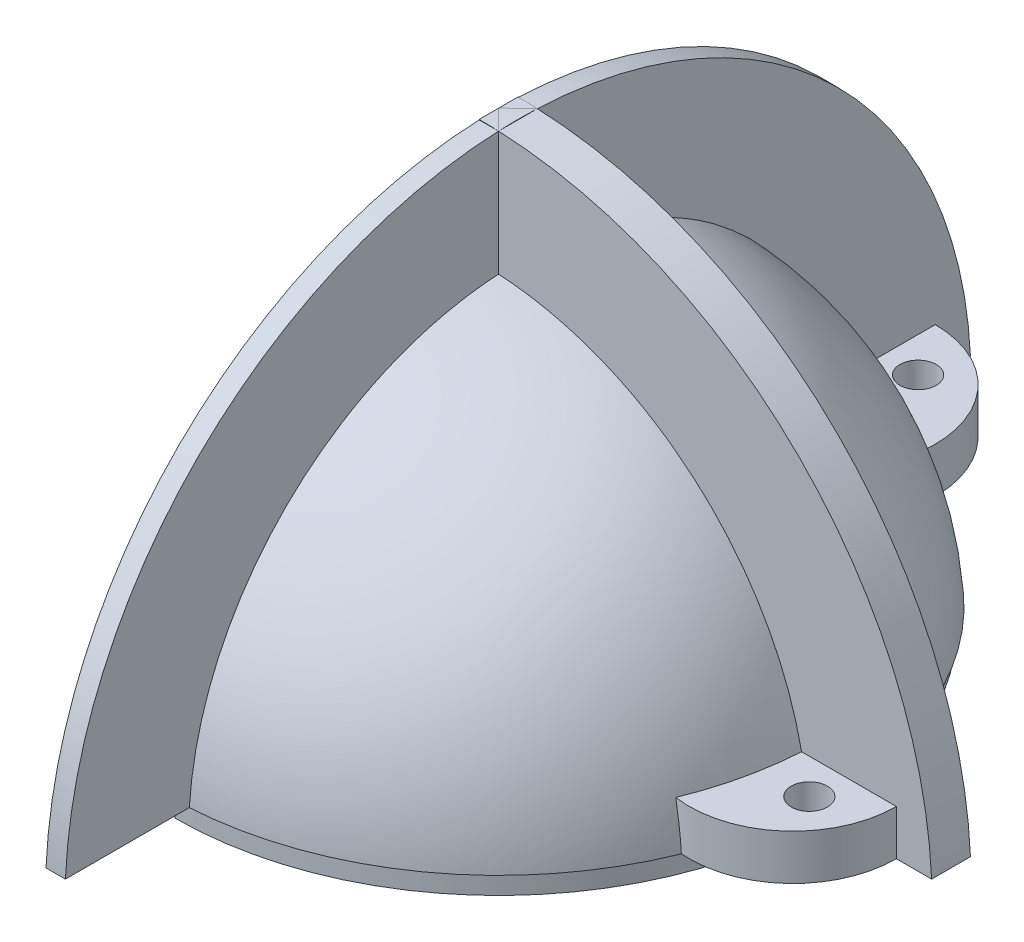
ISO-10303-21;
HEADER;
FILE_DESCRIPTION(('STEP AP214'),'2;1');
FILE_NAME('part.step','',(''),(''),'','','');
FILE_SCHEMA(('AUTOMOTIVE_DESIGN { 1 0 10303 214 1 1 1 1 }'));
ENDSEC;
DATA;
#1=APPLICATION_CONTEXT('core data for automotive mechanical design processes');
#2=APPLICATION_PROTOCOL_DEFINITION('international standard','automotive_design',2000,#1);
#3=PRODUCT_CONTEXT('',#1,'mechanical');
#4=PRODUCT('Part','Part','',(#3));
#5=PRODUCT_RELATED_PRODUCT_CATEGORY('part','',(#4));
#6=PRODUCT_DEFINITION_FORMATION('','',#4);
#7=PRODUCT_DEFINITION_CONTEXT('part definition',#1,'design');
#8=PRODUCT_DEFINITION('design','',#6,#7);
#9=PRODUCT_DEFINITION_SHAPE('','',#8);
#10=(LENGTH_UNIT() NAMED_UNIT(*) SI_UNIT(.MILLI.,.METRE.));
#11=(NAMED_UNIT(*) PLANE_ANGLE_UNIT() SI_UNIT($,.RADIAN.));
#12=(NAMED_UNIT(*) SI_UNIT($,.STERADIAN.) SOLID_ANGLE_UNIT());
#13=UNCERTAINTY_MEASURE_WITH_UNIT(LENGTH_MEASURE(1.E-05),#10,'distance_accuracy_value','');
#14=(GEOMETRIC_REPRESENTATION_CONTEXT(3) GLOBAL_UNCERTAINTY_ASSIGNED_CONTEXT((#13)) GLOBAL_UNIT_ASSIGNED_CONTEXT((#10,
#11,#12)) REPRESENTATION_CONTEXT('',''));
#15=CARTESIAN_POINT('',(0.,0.,0.));
#16=DIRECTION('',(0.,0.,1.));
#17=DIRECTION('',(1.,0.,0.));
#18=AXIS2_PLACEMENT_3D('',#15,#16,#17);
#19=CARTESIAN_POINT('',(0.,0.,0.));
#20=DIRECTION('',(0.,1.,0.));
#21=DIRECTION('',(0.,0.,1.));
#22=AXIS2_PLACEMENT_3D('',#19,#20,#21);
#23=PLANE('',#22);
#24=CARTESIAN_POINT('',(0.,0.,0.));
#25=DIRECTION('',(0.,-1.,0.));
#26=DIRECTION('',(0.,0.,-1.));
#27=AXIS2_PLACEMENT_3D('',#24,#25,#26);
#28=CIRCLE('',#27,25.);
#29=CARTESIAN_POINT('',(0.,0.,-25.));
#30=VERTEX_POINT('',#29);
#31=CARTESIAN_POINT('',(0.,0.,25.));
#32=VERTEX_POINT('',#31);
#33=EDGE_CURVE('E366',#30,#32,#28,.T.);
#34=ORIENTED_EDGE('',*,*,#33,.T.);
#35=DIRECTION('',(0.,0.,-1.));
#36=VECTOR('',#35,1.);
#37=CARTESIAN_POINT('',(0.,0.,0.));
#38=LINE('',#37,#36);
#39=CARTESIAN_POINT('',(0.,0.,24.285));
#40=VERTEX_POINT('',#39);
#41=EDGE_CURVE('E368',#32,#40,#38,.T.);
#42=ORIENTED_EDGE('',*,*,#41,.T.);
#43=CARTESIAN_POINT('',(0.,0.,0.));
#44=DIRECTION('',(0.,-1.,0.));
#45=DIRECTION('',(0.,0.,-1.));
#46=AXIS2_PLACEMENT_3D('',#43,#44,#45);
#47=CIRCLE('',#46,24.285);
#48=CARTESIAN_POINT('',(0.,0.,-24.285));
#49=VERTEX_POINT('',#48);
#50=EDGE_CURVE('E229',#49,#40,#47,.T.);
#51=ORIENTED_EDGE('',*,*,#50,.F.);
#52=EDGE_CURVE('E370',#49,#30,#38,.T.);
#53=ORIENTED_EDGE('',*,*,#52,.T.);
#54=EDGE_LOOP('',(#34,#42,#51,#53));
#55=FACE_BOUND('',#54,.T.);
#56=ADVANCED_FACE('F39',(#55),#23,.F.);
#57=CARTESIAN_POINT('',(0.,0.,0.));
#58=DIRECTION('',(0.,-1.,0.));
#59=DIRECTION('',(0.,0.,-1.));
#60=AXIS2_PLACEMENT_3D('',#57,#58,#59);
#61=CYLINDRICAL_SURFACE('',#60,20.885);
#62=CARTESIAN_POINT('',(0.,0.,0.));
#63=DIRECTION('',(0.,-1.,0.));
#64=DIRECTION('',(0.,0.,-1.));
#65=AXIS2_PLACEMENT_3D('',#62,#63,#64);
#66=CIRCLE('',#65,20.885);
#67=CARTESIAN_POINT('',(0.,0.,-20.885));
#68=VERTEX_POINT('',#67);
#69=CARTESIAN_POINT('',(0.,0.,20.885));
#70=VERTEX_POINT('',#69);
#71=EDGE_CURVE('E241',#68,#70,#66,.T.);
#72=ORIENTED_EDGE('',*,*,#71,.T.);
#73=DIRECTION('',(0.,-1.,0.));
#74=VECTOR('',#73,1.);
#75=CARTESIAN_POINT('',(0.,0.,20.885));
#76=LINE('',#75,#74);
#77=CARTESIAN_POINT('',(0.,11.7939391214301,20.885));
#78=VERTEX_POINT('',#77);
#79=EDGE_CURVE('E54',#70,#78,#76,.F.);
#80=ORIENTED_EDGE('',*,*,#79,.T.);
#81=CARTESIAN_POINT('',(0.,11.7939391214301,0.));
#82=DIRECTION('',(0.,-1.,0.));
#83=DIRECTION('',(0.,0.,-1.));
#84=AXIS2_PLACEMENT_3D('',#81,#82,#83);
#85=CIRCLE('',#84,20.885);
#86=CARTESIAN_POINT('',(0.,11.7939391214301,-20.885));
#87=VERTEX_POINT('',#86);
#88=EDGE_CURVE('E227',#87,#78,#85,.T.);
#89=ORIENTED_EDGE('',*,*,#88,.F.);
#90=DIRECTION('',(0.,-1.,0.));
#91=VECTOR('',#90,1.);
#92=CARTESIAN_POINT('',(0.,0.,-20.885));
#93=LINE('',#92,#91);
#94=EDGE_CURVE('E395',#87,#68,#93,.T.);
#95=ORIENTED_EDGE('',*,*,#94,.T.);
#96=EDGE_LOOP('',(#72,#80,#89,#95));
#97=FACE_BOUND('',#96,.T.);
#98=ADVANCED_FACE('F41',(#97),#61,.F.);
#99=CARTESIAN_POINT('',(0.,0.,0.));
#100=DIRECTION('',(0.,-1.,0.));
#101=DIRECTION('',(-1.,0.,0.));
#102=AXIS2_PLACEMENT_3D('',#99,#100,#101);
#103=SPHERICAL_SURFACE('',#102,23.985);
#104=ORIENTED_EDGE('',*,*,#88,.T.);
#105=CARTESIAN_POINT('',(0.,0.,0.));
#106=DIRECTION('',(1.,0.,0.));
#107=DIRECTION('',(0.,0.,-1.));
#108=AXIS2_PLACEMENT_3D('',#105,#106,#107);
#109=CIRCLE('',#108,23.985);
#110=EDGE_CURVE('E60',#78,#87,#109,.F.);
#111=ORIENTED_EDGE('',*,*,#110,.T.);
#112=EDGE_LOOP('',(#104,#111));
#113=FACE_BOUND('',#112,.T.);
#114=ADVANCED_FACE('F357',(#113),#103,.F.);
#115=CARTESIAN_POINT('',(0.,0.,0.));
#116=DIRECTION('',(0.,-1.,0.));
#117=DIRECTION('',(0.,0.,-1.));
#118=AXIS2_PLACEMENT_3D('',#115,#116,#117);
#119=CYLINDRICAL_SURFACE('',#118,24.285);
#120=ORIENTED_EDGE('',*,*,#50,.T.);
#121=DIRECTION('',(0.,-1.,0.));
#122=VECTOR('',#121,1.);
#123=CARTESIAN_POINT('',(0.,0.,24.285));
#124=LINE('',#123,#122);
#125=CARTESIAN_POINT('',(0.,0.5,24.285));
#126=VERTEX_POINT('',#125);
#127=EDGE_CURVE('E378',#40,#126,#124,.F.);
#128=ORIENTED_EDGE('',*,*,#127,.T.);
#129=CARTESIAN_POINT('',(0.,0.5,0.));
#130=DIRECTION('',(0.,-1.,0.));
#131=DIRECTION('',(0.,0.,-1.));
#132=AXIS2_PLACEMENT_3D('',#129,#130,#131);
#133=CIRCLE('',#132,24.285);
#134=CARTESIAN_POINT('',(0.,0.5,-24.285));
#135=VERTEX_POINT('',#134);
#136=EDGE_CURVE('E232',#135,#126,#133,.T.);
#137=ORIENTED_EDGE('',*,*,#136,.F.);
#138=DIRECTION('',(0.,-1.,0.));
#139=VECTOR('',#138,1.);
#140=CARTESIAN_POINT('',(0.,0.,-24.285));
#141=LINE('',#140,#139);
#142=EDGE_CURVE('E385',#135,#49,#141,.T.);
#143=ORIENTED_EDGE('',*,*,#142,.T.);
#144=EDGE_LOOP('',(#120,#128,#137,#143));
#145=FACE_BOUND('',#144,.T.);
#146=ADVANCED_FACE('F354',(#145),#119,.F.);
#147=CARTESIAN_POINT('',(0.,0.5,0.));
#148=DIRECTION('',(0.,1.,0.));
#149=DIRECTION('',(0.,0.,1.));
#150=AXIS2_PLACEMENT_3D('',#147,#148,#149);
#151=PLANE('',#150);
#152=ORIENTED_EDGE('',*,*,#136,.T.);
#153=DIRECTION('',(0.,0.,-1.));
#154=VECTOR('',#153,1.);
#155=CARTESIAN_POINT('',(0.,0.5,0.));
#156=LINE('',#155,#154);
#157=CARTESIAN_POINT('',(0.,0.5,22.085));
#158=VERTEX_POINT('',#157);
#159=EDGE_CURVE('E497',#126,#158,#156,.T.);
#160=ORIENTED_EDGE('',*,*,#159,.T.);
#161=CARTESIAN_POINT('',(0.,0.5,0.));
#162=DIRECTION('',(0.,-1.,0.));
#163=DIRECTION('',(0.,0.,-1.));
#164=AXIS2_PLACEMENT_3D('',#161,#162,#163);
#165=CIRCLE('',#164,22.085);
#166=CARTESIAN_POINT('',(0.,0.5,-22.085));
#167=VERTEX_POINT('',#166);
#168=EDGE_CURVE('E235',#167,#158,#165,.T.);
#169=ORIENTED_EDGE('',*,*,#168,.F.);
#170=EDGE_CURVE('E374',#167,#135,#156,.T.);
#171=ORIENTED_EDGE('',*,*,#170,.T.);
#172=EDGE_LOOP('',(#152,#160,#169,#171));
#173=FACE_BOUND('',#172,.T.);
#174=ADVANCED_FACE('F350',(#173),#151,.F.);
#175=CARTESIAN_POINT('',(0.,0.,0.));
#176=DIRECTION('',(0.,-1.,0.));
#177=DIRECTION('',(0.,0.,-1.));
#178=AXIS2_PLACEMENT_3D('',#175,#176,#177);
#179=CYLINDRICAL_SURFACE('',#178,22.085);
#180=DIRECTION('',(0.,-1.,0.));
#181=VECTOR('',#180,1.);
#182=CARTESIAN_POINT('',(0.,0.,22.085));
#183=LINE('',#182,#181);
#184=CARTESIAN_POINT('',(0.,0.,22.085));
#185=VERTEX_POINT('',#184);
#186=EDGE_CURVE('E496',#185,#158,#183,.F.);
#187=ORIENTED_EDGE('',*,*,#186,.F.);
#188=CARTESIAN_POINT('',(0.,0.,0.));
#189=DIRECTION('',(0.,-1.,0.));
#190=DIRECTION('',(0.,0.,-1.));
#191=AXIS2_PLACEMENT_3D('',#188,#189,#190);
#192=CIRCLE('',#191,22.085);
#193=CARTESIAN_POINT('',(0.,0.,-22.085));
#194=VERTEX_POINT('',#193);
#195=EDGE_CURVE('E238',#194,#185,#192,.T.);
#196=ORIENTED_EDGE('',*,*,#195,.F.);
#197=DIRECTION('',(0.,-1.,0.));
#198=VECTOR('',#197,1.);
#199=CARTESIAN_POINT('',(0.,0.,-22.085));
#200=LINE('',#199,#198);
#201=EDGE_CURVE('E397',#167,#194,#200,.T.);
#202=ORIENTED_EDGE('',*,*,#201,.F.);
#203=ORIENTED_EDGE('',*,*,#168,.T.);
#204=EDGE_LOOP('',(#187,#196,#202,#203));
#205=FACE_BOUND('',#204,.T.);
#206=ADVANCED_FACE('F346',(#205),#179,.T.);
#207=CARTESIAN_POINT('',(0.,0.,0.));
#208=DIRECTION('',(0.,1.,0.));
#209=DIRECTION('',(0.,0.,1.));
#210=AXIS2_PLACEMENT_3D('',#207,#208,#209);
#211=PLANE('',#210);
#212=ORIENTED_EDGE('',*,*,#195,.T.);
#213=DIRECTION('',(0.,0.,-1.));
#214=VECTOR('',#213,1.);
#215=CARTESIAN_POINT('',(0.,0.,0.));
#216=LINE('',#215,#214);
#217=EDGE_CURVE('E387',#185,#70,#216,.T.);
#218=ORIENTED_EDGE('',*,*,#217,.T.);
#219=ORIENTED_EDGE('',*,*,#71,.F.);
#220=EDGE_CURVE('E391',#68,#194,#216,.T.);
#221=ORIENTED_EDGE('',*,*,#220,.T.);
#222=EDGE_LOOP('',(#212,#218,#219,#221));
#223=FACE_BOUND('',#222,.T.);
#224=ADVANCED_FACE('F342',(#223),#211,.F.);
#225=CARTESIAN_POINT('',(0.,75.1891052434009,0.));
#226=DIRECTION('',(0.,-1.,0.));
#227=DIRECTION('',(0.,0.,-1.));
#228=AXIS2_PLACEMENT_3D('',#225,#226,#227);
#229=CYLINDRICAL_SURFACE('',#228,25.);
#230=DIRECTION('',(0.,-1.,0.));
#231=VECTOR('',#230,1.);
#232=CARTESIAN_POINT('',(0.,75.1891052434009,25.));
#233=LINE('',#232,#231);
#234=CARTESIAN_POINT('',(0.,1.65,25.));
#235=VERTEX_POINT('',#234);
#236=EDGE_CURVE('E212',#32,#235,#233,.F.);
#237=ORIENTED_EDGE('',*,*,#236,.F.);
#238=ORIENTED_EDGE('',*,*,#33,.F.);
#239=DIRECTION('',(0.,-1.,0.));
#240=VECTOR('',#239,1.);
#241=CARTESIAN_POINT('',(0.,75.1891052434009,-25.));
#242=LINE('',#241,#240);
#243=CARTESIAN_POINT('',(0.,1.65,-25.));
#244=VERTEX_POINT('',#243);
#245=EDGE_CURVE('E389',#244,#30,#242,.T.);
#246=ORIENTED_EDGE('',*,*,#245,.F.);
#247=CARTESIAN_POINT('',(0.,1.65,0.));
#248=DIRECTION('',(0.,-1.,0.));
#249=DIRECTION('',(0.,0.,-1.));
#250=AXIS2_PLACEMENT_3D('',#247,#248,#249);
#251=CIRCLE('',#250,25.);
#252=EDGE_CURVE('E373',#235,#244,#251,.F.);
#253=ORIENTED_EDGE('',*,*,#252,.F.);
#254=EDGE_LOOP('',(#237,#238,#246,#253));
#255=FACE_BOUND('',#254,.T.);
#256=ADVANCED_FACE('F345',(#255),#229,.T.);
#257=CARTESIAN_POINT('',(0.,0.,-1.5));
#258=DIRECTION('',(0.,0.,1.));
#259=DIRECTION('',(1.,0.,0.));
#260=AXIS2_PLACEMENT_3D('',#257,#258,#259);
#261=CYLINDRICAL_SURFACE('',#260,35.);
#262=DIRECTION('',(0.,0.,1.));
#263=VECTOR('',#262,1.);
#264=CARTESIAN_POINT('',(0.,35.,-1.5));
#265=LINE('',#264,#263);
#266=CARTESIAN_POINT('',(0.,35.,1.5));
#267=VERTEX_POINT('',#266);
#268=CARTESIAN_POINT('',(0.,35.,0.));
#269=VERTEX_POINT('',#268);
#270=EDGE_CURVE('E383',#267,#269,#265,.F.);
#271=ORIENTED_EDGE('',*,*,#270,.F.);
#272=CARTESIAN_POINT('',(0.,0.,1.5));
#273=DIRECTION('',(0.,0.,1.));
#274=DIRECTION('',(-1.,0.,0.));
#275=AXIS2_PLACEMENT_3D('',#272,#273,#274);
#276=CIRCLE('',#275,35.);
#277=CARTESIAN_POINT('',(1.5,34.9678423698117,1.5));
#278=VERTEX_POINT('',#277);
#279=EDGE_CURVE('E257',#278,#267,#276,.T.);
#280=ORIENTED_EDGE('',*,*,#279,.F.);
#281=CARTESIAN_POINT('',(0.,0.,0.));
#282=DIRECTION('',(-0.707106781186547,0.,0.707106781186547));
#283=DIRECTION('',(0.707106781186547,0.,0.707106781186547));
#284=AXIS2_PLACEMENT_3D('',#281,#282,#283);
#285=ELLIPSE('',#284,49.4974746830583,35.);
#286=EDGE_CURVE('E263',#269,#278,#285,.F.);
#287=ORIENTED_EDGE('',*,*,#286,.F.);
#288=EDGE_LOOP('',(#271,#280,#287));
#289=FACE_BOUND('',#288,.T.);
#290=ADVANCED_FACE('F321',(#289),#261,.T.);
#291=CARTESIAN_POINT('',(-1.5,0.,0.));
#292=DIRECTION('',(1.,0.,0.));
#293=DIRECTION('',(0.,0.,-1.));
#294=AXIS2_PLACEMENT_3D('',#291,#292,#293);
#295=CYLINDRICAL_SURFACE('',#294,35.);
#296=CARTESIAN_POINT('',(1.5,0.,0.));
#297=DIRECTION('',(1.,0.,0.));
#298=DIRECTION('',(0.,0.,-1.));
#299=AXIS2_PLACEMENT_3D('',#296,#297,#298);
#300=CIRCLE('',#299,35.);
#301=CARTESIAN_POINT('',(1.5,34.9678423698117,-1.5));
#302=VERTEX_POINT('',#301);
#303=EDGE_CURVE('E273',#302,#278,#300,.T.);
#304=ORIENTED_EDGE('',*,*,#303,.F.);
#305=CARTESIAN_POINT('',(0.,0.,0.));
#306=DIRECTION('',(0.707106781186547,0.,0.707106781186547));
#307=DIRECTION('',(-0.707106781186547,0.,0.707106781186547));
#308=AXIS2_PLACEMENT_3D('',#305,#306,#307);
#309=ELLIPSE('',#308,49.4974746830583,35.);
#310=EDGE_CURVE('E258',#302,#269,#309,.T.);
#311=ORIENTED_EDGE('',*,*,#310,.T.);
#312=ORIENTED_EDGE('',*,*,#286,.T.);
#313=EDGE_LOOP('',(#304,#311,#312));
#314=FACE_BOUND('',#313,.T.);
#315=ADVANCED_FACE('F317',(#314),#295,.T.);
#316=DIRECTION('',(0.,0.,1.));
#317=VECTOR('',#316,1.);
#318=CARTESIAN_POINT('',(0.,35.,-1.5));
#319=LINE('',#318,#317);
#320=CARTESIAN_POINT('',(0.,35.,-1.5));
#321=VERTEX_POINT('',#320);
#322=EDGE_CURVE('E379',#269,#321,#319,.F.);
#323=ORIENTED_EDGE('',*,*,#322,.F.);
#324=ORIENTED_EDGE('',*,*,#310,.F.);
#325=CARTESIAN_POINT('',(0.,0.,-1.5));
#326=DIRECTION('',(0.,0.,1.));
#327=DIRECTION('',(-1.,0.,0.));
#328=AXIS2_PLACEMENT_3D('',#325,#326,#327);
#329=CIRCLE('',#328,35.);
#330=EDGE_CURVE('E253',#302,#321,#329,.T.);
#331=ORIENTED_EDGE('',*,*,#330,.T.);
#332=EDGE_LOOP('',(#323,#324,#331));
#333=FACE_BOUND('',#332,.T.);
#334=ADVANCED_FACE('F320',(#333),#261,.T.);
#335=CARTESIAN_POINT('',(0.,0.,1.5));
#336=DIRECTION('',(0.,0.,-1.));
#337=DIRECTION('',(-1.,0.,0.));
#338=AXIS2_PLACEMENT_3D('',#335,#336,#337);
#339=PLANE('',#338);
#340=ORIENTED_EDGE('',*,*,#279,.T.);
#341=DIRECTION('',(0.,-1.,0.));
#342=VECTOR('',#341,1.);
#343=CARTESIAN_POINT('',(0.,0.,1.5));
#344=LINE('',#343,#342);
#345=CARTESIAN_POINT('',(0.,34.9678423698117,1.5));
#346=VERTEX_POINT('',#345);
#347=EDGE_CURVE('E206',#267,#346,#344,.T.);
#348=ORIENTED_EDGE('',*,*,#347,.T.);
#349=DIRECTION('',(1.,0.,0.));
#350=VECTOR('',#349,1.);
#351=CARTESIAN_POINT('',(-1.5,34.9678423698117,1.5));
#352=LINE('',#351,#350);
#353=EDGE_CURVE('E203',#346,#278,#352,.T.);
#354=ORIENTED_EDGE('',*,*,#353,.T.);
#355=EDGE_LOOP('',(#340,#348,#354));
#356=FACE_BOUND('',#355,.T.);
#357=ADVANCED_FACE('F314',(#356),#339,.F.);
#358=CARTESIAN_POINT('',(1.5,0.,0.));
#359=DIRECTION('',(1.,0.,0.));
#360=DIRECTION('',(0.,0.,-1.));
#361=AXIS2_PLACEMENT_3D('',#358,#359,#360);
#362=PLANE('',#361);
#363=ORIENTED_EDGE('',*,*,#303,.T.);
#364=DIRECTION('',(0.,0.,1.));
#365=VECTOR('',#364,1.);
#366=CARTESIAN_POINT('',(1.5,34.9678423698117,-1.5));
#367=LINE('',#366,#365);
#368=EDGE_CURVE('E268',#278,#302,#367,.F.);
#369=ORIENTED_EDGE('',*,*,#368,.T.);
#370=EDGE_LOOP('',(#363,#369));
#371=FACE_BOUND('',#370,.T.);
#372=ADVANCED_FACE('F310',(#371),#362,.T.);
#373=CARTESIAN_POINT('',(0.,0.,-1.5));
#374=DIRECTION('',(0.,0.,-1.));
#375=DIRECTION('',(-1.,0.,0.));
#376=AXIS2_PLACEMENT_3D('',#373,#374,#375);
#377=PLANE('',#376);
#378=DIRECTION('',(0.,-1.,0.));
#379=VECTOR('',#378,1.);
#380=CARTESIAN_POINT('',(0.,0.,-1.5));
#381=LINE('',#380,#379);
#382=CARTESIAN_POINT('',(0.,34.9678423698117,-1.5));
#383=VERTEX_POINT('',#382);
#384=EDGE_CURVE('E495',#321,#383,#381,.T.);
#385=ORIENTED_EDGE('',*,*,#384,.F.);
#386=ORIENTED_EDGE('',*,*,#330,.F.);
#387=DIRECTION('',(1.,0.,0.));
#388=VECTOR('',#387,1.);
#389=CARTESIAN_POINT('',(-1.5,34.9678423698117,-1.5));
#390=LINE('',#389,#388);
#391=EDGE_CURVE('E261',#383,#302,#390,.T.);
#392=ORIENTED_EDGE('',*,*,#391,.F.);
#393=EDGE_LOOP('',(#385,#386,#392));
#394=FACE_BOUND('',#393,.T.);
#395=ADVANCED_FACE('F313',(#394),#377,.T.);
#396=CARTESIAN_POINT('',(0.,0.,0.));
#397=DIRECTION('',(1.,0.,0.));
#398=DIRECTION('',(0.,0.,-1.));
#399=AXIS2_PLACEMENT_3D('',#396,#397,#398);
#400=CIRCLE('',#399,35.);
#401=CARTESIAN_POINT('',(0.,1.65,34.9610855094632));
#402=VERTEX_POINT('',#401);
#403=EDGE_CURVE('E201',#402,#346,#400,.F.);
#404=ORIENTED_EDGE('',*,*,#403,.F.);
#405=DIRECTION('',(1.,0.,0.));
#406=VECTOR('',#405,1.);
#407=CARTESIAN_POINT('',(-1.5,1.65,34.9610855094632));
#408=LINE('',#407,#406);
#409=CARTESIAN_POINT('',(1.5,1.65,34.9610855094632));
#410=VERTEX_POINT('',#409);
#411=EDGE_CURVE('E185',#410,#402,#408,.F.);
#412=ORIENTED_EDGE('',*,*,#411,.F.);
#413=EDGE_CURVE('E197',#278,#410,#300,.T.);
#414=ORIENTED_EDGE('',*,*,#413,.F.);
#415=ORIENTED_EDGE('',*,*,#353,.F.);
#416=EDGE_LOOP('',(#404,#412,#414,#415));
#417=FACE_BOUND('',#416,.T.);
#418=ADVANCED_FACE('F202',(#417),#295,.T.);
#419=CARTESIAN_POINT('',(28.212839524984,5.15,4.2));
#420=DIRECTION('',(0.,-1.,0.));
#421=DIRECTION('',(0.,0.,-1.));
#422=AXIS2_PLACEMENT_3D('',#419,#420,#421);
#423=CYLINDRICAL_SURFACE('',#422,1.4);
#424=CARTESIAN_POINT('',(28.212839524984,5.15,4.2));
#425=DIRECTION('',(0.,-1.,0.));
#426=DIRECTION('',(0.,0.,-1.));
#427=AXIS2_PLACEMENT_3D('',#424,#425,#426);
#428=CIRCLE('',#427,1.4);
#429=CARTESIAN_POINT('',(28.212839524984,5.15,2.8));
#430=VERTEX_POINT('',#429);
#431=EDGE_CURVE('E445',#430,#430,#428,.T.);
#432=CARTESIAN_POINT('',(28.212839524984,1.65,4.2));
#433=DIRECTION('',(0.,-1.,0.));
#434=DIRECTION('',(0.,0.,-1.));
#435=AXIS2_PLACEMENT_3D('',#432,#433,#434);
#436=CIRCLE('',#435,1.4);
#437=CARTESIAN_POINT('',(28.212839524984,1.65,2.8));
#438=VERTEX_POINT('',#437);
#439=EDGE_CURVE('E448',#438,#438,#436,.T.);
#440=CARTESIAN_POINT('',(28.212839524984,5.15,2.8));
#441=CARTESIAN_POINT('',(28.212839524984,5.11354166666667,2.8));
#442=CARTESIAN_POINT('',(28.212839524984,5.07708333333333,2.8));
#443=CARTESIAN_POINT('',(28.212839524984,5.00416666666667,2.8));
#444=CARTESIAN_POINT('',(28.212839524984,4.96770833333333,2.8));
#445=CARTESIAN_POINT('',(28.212839524984,4.89479166666667,2.8));
#446=CARTESIAN_POINT('',(28.212839524984,4.85833333333333,2.8));
#447=CARTESIAN_POINT('',(28.212839524984,4.78541666666667,2.8));
#448=CARTESIAN_POINT('',(28.212839524984,4.74895833333333,2.8));
#449=CARTESIAN_POINT('',(28.212839524984,4.67604166666667,2.8));
#450=CARTESIAN_POINT('',(28.212839524984,4.63958333333333,2.8));
#451=CARTESIAN_POINT('',(28.212839524984,4.56666666666666,2.8));
#452=CARTESIAN_POINT('',(28.212839524984,4.53020833333333,2.8));
#453=CARTESIAN_POINT('',(28.212839524984,4.45729166666666,2.8));
#454=CARTESIAN_POINT('',(28.212839524984,4.42083333333333,2.8));
#455=CARTESIAN_POINT('',(28.212839524984,4.34791666666667,2.8));
#456=CARTESIAN_POINT('',(28.212839524984,4.31145833333333,2.8));
#457=CARTESIAN_POINT('',(28.212839524984,4.23854166666667,2.8));
#458=CARTESIAN_POINT('',(28.212839524984,4.20208333333333,2.8));
#459=CARTESIAN_POINT('',(28.212839524984,4.12916666666667,2.8));
#460=CARTESIAN_POINT('',(28.212839524984,4.09270833333333,2.8));
#461=CARTESIAN_POINT('',(28.212839524984,4.01979166666667,2.8));
#462=CARTESIAN_POINT('',(28.212839524984,3.98333333333333,2.8));
#463=CARTESIAN_POINT('',(28.212839524984,3.91041666666667,2.8));
#464=CARTESIAN_POINT('',(28.212839524984,3.87395833333333,2.8));
#465=CARTESIAN_POINT('',(28.212839524984,3.80104166666667,2.8));
#466=CARTESIAN_POINT('',(28.212839524984,3.76458333333333,2.8));
#467=CARTESIAN_POINT('',(28.212839524984,3.69166666666667,2.8));
#468=CARTESIAN_POINT('',(28.212839524984,3.65520833333333,2.8));
#469=CARTESIAN_POINT('',(28.212839524984,3.58229166666667,2.8));
#470=CARTESIAN_POINT('',(28.212839524984,3.54583333333333,2.8));
#471=CARTESIAN_POINT('',(28.212839524984,3.47291666666667,2.8));
#472=CARTESIAN_POINT('',(28.212839524984,3.43645833333333,2.8));
#473=CARTESIAN_POINT('',(28.212839524984,3.36354166666667,2.8));
#474=CARTESIAN_POINT('',(28.212839524984,3.32708333333333,2.8));
#475=CARTESIAN_POINT('',(28.212839524984,3.25416666666667,2.8));
#476=CARTESIAN_POINT('',(28.212839524984,3.21770833333333,2.8));
#477=CARTESIAN_POINT('',(28.212839524984,3.14479166666667,2.8));
#478=CARTESIAN_POINT('',(28.212839524984,3.10833333333333,2.8));
#479=CARTESIAN_POINT('',(28.212839524984,3.03541666666667,2.8));
#480=CARTESIAN_POINT('',(28.212839524984,2.99895833333333,2.8));
#481=CARTESIAN_POINT('',(28.212839524984,2.92604166666667,2.8));
#482=CARTESIAN_POINT('',(28.212839524984,2.88958333333333,2.8));
#483=CARTESIAN_POINT('',(28.212839524984,2.81666666666667,2.8));
#484=CARTESIAN_POINT('',(28.212839524984,2.78020833333333,2.8));
#485=CARTESIAN_POINT('',(28.212839524984,2.70729166666667,2.8));
#486=CARTESIAN_POINT('',(28.212839524984,2.67083333333333,2.8));
#487=CARTESIAN_POINT('',(28.212839524984,2.59791666666667,2.8));
#488=CARTESIAN_POINT('',(28.212839524984,2.56145833333333,2.8));
#489=CARTESIAN_POINT('',(28.212839524984,2.48854166666667,2.8));
#490=CARTESIAN_POINT('',(28.212839524984,2.45208333333333,2.8));
#491=CARTESIAN_POINT('',(28.212839524984,2.37916666666667,2.8));
#492=CARTESIAN_POINT('',(28.212839524984,2.34270833333333,2.8));
#493=CARTESIAN_POINT('',(28.212839524984,2.26979166666667,2.8));
#494=CARTESIAN_POINT('',(28.212839524984,2.23333333333333,2.8));
#495=CARTESIAN_POINT('',(28.212839524984,2.16041666666667,2.8));
#496=CARTESIAN_POINT('',(28.212839524984,2.12395833333333,2.8));
#497=CARTESIAN_POINT('',(28.212839524984,2.05104166666667,2.8));
#498=CARTESIAN_POINT('',(28.212839524984,2.01458333333333,2.8));
#499=CARTESIAN_POINT('',(28.212839524984,1.94166666666667,2.8));
#500=CARTESIAN_POINT('',(28.212839524984,1.90520833333333,2.8));
#501=CARTESIAN_POINT('',(28.212839524984,1.83229166666667,2.8));
#502=CARTESIAN_POINT('',(28.212839524984,1.79583333333333,2.8));
#503=CARTESIAN_POINT('',(28.212839524984,1.72291666666667,2.8));
#504=CARTESIAN_POINT('',(28.212839524984,1.68645833333333,2.8));
#505=CARTESIAN_POINT('',(28.212839524984,1.65,2.8));
#506=B_SPLINE_CURVE_WITH_KNOTS('',3,(#440,#441,#442,#443,#444,#445,#446,#447,#448,#449,#450,
#451,#452,#453,#454,#455,#456,#457,#458,#459,#460,#461,#462,#463,#464,#465,#466,#467,#468,#469,
#470,#471,#472,#473,#474,#475,#476,#477,#478,#479,#480,#481,#482,#483,#484,#485,#486,#487,#488,
#489,#490,#491,#492,#493,#494,#495,#496,#497,#498,#499,#500,#501,#502,#503,#504,#505),
.UNSPECIFIED.,.F.,.F.,(4,2,2,2,2,2,2,2,2,2,2,2,2,2,2,2,2,2,2,2,2,2,2,2,2,2,2,2,2,2,2,2,4),(0.,
0.109375,0.21875,0.328125,0.4375,0.546875,0.656250000000001,0.765625000000001,0.875,0.984375,
1.09375,1.203125,1.3125,1.421875,1.53125,1.640625,1.75,1.859375,1.96875,2.078125,2.1875,
2.296875,2.40625,2.515625,2.625,2.734375,2.84375,2.953125,3.0625,3.171875,3.28125,3.390625,3.5),.UNSPECIFIED.);
#507=EDGE_CURVE('BSEAM338',#430,#438,#506,.T.);
#508=ORIENTED_EDGE('',*,*,#431,.F.);
#509=ORIENTED_EDGE('',*,*,#439,.T.);
#510=ORIENTED_EDGE('',*,*,#507,.T.);
#511=ORIENTED_EDGE('',*,*,#507,.F.);
#512=EDGE_LOOP('',(#508,#510,#509,#511));
#513=FACE_BOUND('',#512,.T.);
#514=ADVANCED_FACE('F338',(#513),#423,.F.);
#515=DIRECTION('',(0.,0.,1.));
#516=VECTOR('',#515,1.);
#517=CARTESIAN_POINT('',(34.9610855094632,1.65,-1.5));
#518=LINE('',#517,#516);
#519=CARTESIAN_POINT('',(34.9610855094632,1.65,-1.5));
#520=VERTEX_POINT('',#519);
#521=CARTESIAN_POINT('',(34.9610855094632,1.65,1.5));
#522=VERTEX_POINT('',#521);
#523=EDGE_CURVE('E243',#520,#522,#518,.T.);
#524=ORIENTED_EDGE('',*,*,#523,.F.);
#525=EDGE_CURVE('E250',#520,#302,#329,.T.);
#526=ORIENTED_EDGE('',*,*,#525,.T.);
#527=ORIENTED_EDGE('',*,*,#368,.F.);
#528=EDGE_CURVE('E254',#522,#278,#276,.T.);
#529=ORIENTED_EDGE('',*,*,#528,.F.);
#530=EDGE_LOOP('',(#524,#526,#527,#529));
#531=FACE_BOUND('',#530,.T.);
#532=ADVANCED_FACE('F334',(#531),#261,.T.);
#533=CARTESIAN_POINT('',(4.2,5.15,-28.212839524984));
#534=DIRECTION('',(0.,-1.,0.));
#535=DIRECTION('',(0.,0.,-1.));
#536=AXIS2_PLACEMENT_3D('',#533,#534,#535);
#537=CYLINDRICAL_SURFACE('',#536,1.4);
#538=CARTESIAN_POINT('',(4.2,5.15,-28.212839524984));
#539=DIRECTION('',(0.,-1.,0.));
#540=DIRECTION('',(0.,0.,-1.));
#541=AXIS2_PLACEMENT_3D('',#538,#539,#540);
#542=CIRCLE('',#541,1.4);
#543=CARTESIAN_POINT('',(4.2,5.15,-29.612839524984));
#544=VERTEX_POINT('',#543);
#545=EDGE_CURVE('E406',#544,#544,#542,.T.);
#546=CARTESIAN_POINT('',(4.2,1.65,-28.212839524984));
#547=DIRECTION('',(0.,-1.,0.));
#548=DIRECTION('',(0.,0.,-1.));
#549=AXIS2_PLACEMENT_3D('',#546,#547,#548);
#550=CIRCLE('',#549,1.4);
#551=CARTESIAN_POINT('',(4.2,1.65,-29.612839524984));
#552=VERTEX_POINT('',#551);
#553=EDGE_CURVE('E405',#552,#552,#550,.T.);
#554=CARTESIAN_POINT('',(4.2,5.15,-29.612839524984));
#555=CARTESIAN_POINT('',(4.2,5.11354166666667,-29.612839524984));
#556=CARTESIAN_POINT('',(4.2,5.07708333333333,-29.612839524984));
#557=CARTESIAN_POINT('',(4.2,5.00416666666667,-29.612839524984));
#558=CARTESIAN_POINT('',(4.2,4.96770833333333,-29.612839524984));
#559=CARTESIAN_POINT('',(4.2,4.89479166666667,-29.612839524984));
#560=CARTESIAN_POINT('',(4.2,4.85833333333333,-29.612839524984));
#561=CARTESIAN_POINT('',(4.2,4.78541666666667,-29.612839524984));
#562=CARTESIAN_POINT('',(4.2,4.74895833333333,-29.612839524984));
#563=CARTESIAN_POINT('',(4.2,4.67604166666667,-29.612839524984));
#564=CARTESIAN_POINT('',(4.2,4.63958333333333,-29.612839524984));
#565=CARTESIAN_POINT('',(4.2,4.56666666666666,-29.612839524984));
#566=CARTESIAN_POINT('',(4.2,4.53020833333333,-29.612839524984));
#567=CARTESIAN_POINT('',(4.2,4.45729166666666,-29.612839524984));
#568=CARTESIAN_POINT('',(4.2,4.42083333333333,-29.612839524984));
#569=CARTESIAN_POINT('',(4.2,4.34791666666667,-29.612839524984));
#570=CARTESIAN_POINT('',(4.2,4.31145833333333,-29.612839524984));
#571=CARTESIAN_POINT('',(4.2,4.23854166666667,-29.612839524984));
#572=CARTESIAN_POINT('',(4.2,4.20208333333333,-29.612839524984));
#573=CARTESIAN_POINT('',(4.2,4.12916666666667,-29.612839524984));
#574=CARTESIAN_POINT('',(4.2,4.09270833333333,-29.612839524984));
#575=CARTESIAN_POINT('',(4.2,4.01979166666667,-29.612839524984));
#576=CARTESIAN_POINT('',(4.2,3.98333333333333,-29.612839524984));
#577=CARTESIAN_POINT('',(4.2,3.91041666666667,-29.612839524984));
#578=CARTESIAN_POINT('',(4.2,3.87395833333333,-29.612839524984));
#579=CARTESIAN_POINT('',(4.2,3.80104166666667,-29.612839524984));
#580=CARTESIAN_POINT('',(4.2,3.76458333333333,-29.612839524984));
#581=CARTESIAN_POINT('',(4.2,3.69166666666667,-29.612839524984));
#582=CARTESIAN_POINT('',(4.2,3.65520833333333,-29.612839524984));
#583=CARTESIAN_POINT('',(4.2,3.58229166666667,-29.612839524984));
#584=CARTESIAN_POINT('',(4.2,3.54583333333333,-29.612839524984));
#585=CARTESIAN_POINT('',(4.2,3.47291666666667,-29.612839524984));
#586=CARTESIAN_POINT('',(4.2,3.43645833333333,-29.612839524984));
#587=CARTESIAN_POINT('',(4.2,3.36354166666667,-29.612839524984));
#588=CARTESIAN_POINT('',(4.2,3.32708333333333,-29.612839524984));
#589=CARTESIAN_POINT('',(4.2,3.25416666666667,-29.612839524984));
#590=CARTESIAN_POINT('',(4.2,3.21770833333333,-29.612839524984));
#591=CARTESIAN_POINT('',(4.2,3.14479166666667,-29.612839524984));
#592=CARTESIAN_POINT('',(4.2,3.10833333333333,-29.612839524984));
#593=CARTESIAN_POINT('',(4.2,3.03541666666667,-29.612839524984));
#594=CARTESIAN_POINT('',(4.2,2.99895833333333,-29.612839524984));
#595=CARTESIAN_POINT('',(4.2,2.92604166666667,-29.612839524984));
#596=CARTESIAN_POINT('',(4.2,2.88958333333333,-29.612839524984));
#597=CARTESIAN_POINT('',(4.2,2.81666666666667,-29.612839524984));
#598=CARTESIAN_POINT('',(4.2,2.78020833333333,-29.612839524984));
#599=CARTESIAN_POINT('',(4.2,2.70729166666667,-29.612839524984));
#600=CARTESIAN_POINT('',(4.2,2.67083333333333,-29.612839524984));
#601=CARTESIAN_POINT('',(4.2,2.59791666666667,-29.612839524984));
#602=CARTESIAN_POINT('',(4.2,2.56145833333333,-29.612839524984));
#603=CARTESIAN_POINT('',(4.2,2.48854166666667,-29.612839524984));
#604=CARTESIAN_POINT('',(4.2,2.45208333333333,-29.612839524984));
#605=CARTESIAN_POINT('',(4.2,2.37916666666667,-29.612839524984));
#606=CARTESIAN_POINT('',(4.2,2.34270833333333,-29.612839524984));
#607=CARTESIAN_POINT('',(4.2,2.26979166666667,-29.612839524984));
#608=CARTESIAN_POINT('',(4.2,2.23333333333333,-29.612839524984));
#609=CARTESIAN_POINT('',(4.2,2.16041666666667,-29.612839524984));
#610=CARTESIAN_POINT('',(4.2,2.12395833333333,-29.612839524984));
#611=CARTESIAN_POINT('',(4.2,2.05104166666667,-29.612839524984));
#612=CARTESIAN_POINT('',(4.2,2.01458333333333,-29.612839524984));
#613=CARTESIAN_POINT('',(4.2,1.94166666666667,-29.612839524984));
#614=CARTESIAN_POINT('',(4.2,1.90520833333333,-29.612839524984));
#615=CARTESIAN_POINT('',(4.2,1.83229166666667,-29.612839524984));
#616=CARTESIAN_POINT('',(4.2,1.79583333333333,-29.612839524984));
#617=CARTESIAN_POINT('',(4.2,1.72291666666667,-29.612839524984));
#618=CARTESIAN_POINT('',(4.2,1.68645833333333,-29.612839524984));
#619=CARTESIAN_POINT('',(4.2,1.65,-29.612839524984));
#620=B_SPLINE_CURVE_WITH_KNOTS('',3,(#554,#555,#556,#557,#558,#559,#560,#561,#562,#563,#564,
#565,#566,#567,#568,#569,#570,#571,#572,#573,#574,#575,#576,#577,#578,#579,#580,#581,#582,#583,
#584,#585,#586,#587,#588,#589,#590,#591,#592,#593,#594,#595,#596,#597,#598,#599,#600,#601,#602,
#603,#604,#605,#606,#607,#608,#609,#610,#611,#612,#613,#614,#615,#616,#617,#618,#619),
.UNSPECIFIED.,.F.,.F.,(4,2,2,2,2,2,2,2,2,2,2,2,2,2,2,2,2,2,2,2,2,2,2,2,2,2,2,2,2,2,2,2,4),(0.,
0.109375,0.21875,0.328125,0.4375,0.546875,0.656250000000001,0.765625000000001,0.875,0.984375,
1.09375,1.203125,1.3125,1.421875,1.53125,1.640625,1.75,1.859375,1.96875,2.078125,2.1875,
2.296875,2.40625,2.515625,2.625,2.734375,2.84375,2.953125,3.0625,3.171875,3.28125,3.390625,3.5),.UNSPECIFIED.);
#621=EDGE_CURVE('BSEAM337',#544,#552,#620,.T.);
#622=ORIENTED_EDGE('',*,*,#545,.F.);
#623=ORIENTED_EDGE('',*,*,#553,.T.);
#624=ORIENTED_EDGE('',*,*,#621,.T.);
#625=ORIENTED_EDGE('',*,*,#621,.F.);
#626=EDGE_LOOP('',(#622,#624,#623,#625));
#627=FACE_BOUND('',#626,.T.);
#628=ADVANCED_FACE('F337',(#627),#537,.F.);
#629=CARTESIAN_POINT('',(0.,0.,0.));
#630=DIRECTION('',(1.,0.,0.));
#631=DIRECTION('',(0.,0.,-1.));
#632=AXIS2_PLACEMENT_3D('',#629,#630,#631);
#633=CIRCLE('',#632,35.);
#634=CARTESIAN_POINT('',(0.,1.65,-34.9610855094632));
#635=VERTEX_POINT('',#634);
#636=EDGE_CURVE('E492',#383,#635,#633,.F.);
#637=ORIENTED_EDGE('',*,*,#636,.F.);
#638=ORIENTED_EDGE('',*,*,#391,.T.);
#639=CARTESIAN_POINT('',(1.5,1.65,-34.9610855094632));
#640=VERTEX_POINT('',#639);
#641=EDGE_CURVE('E271',#640,#302,#300,.T.);
#642=ORIENTED_EDGE('',*,*,#641,.F.);
#643=DIRECTION('',(1.,0.,0.));
#644=VECTOR('',#643,1.);
#645=CARTESIAN_POINT('',(-1.5,1.65,-34.9610855094632));
#646=LINE('',#645,#644);
#647=EDGE_CURVE('E279',#635,#640,#646,.T.);
#648=ORIENTED_EDGE('',*,*,#647,.F.);
#649=EDGE_LOOP('',(#637,#638,#642,#648));
#650=FACE_BOUND('',#649,.T.);
#651=ADVANCED_FACE('F323',(#650),#295,.T.);
#652=CARTESIAN_POINT('',(-24.2386308400454,1.65,-1.5));
#653=DIRECTION('',(0.,-1.,0.));
#654=DIRECTION('',(0.,0.,-1.));
#655=AXIS2_PLACEMENT_3D('',#652,#653,#654);
#656=PLANE('',#655);
#657=DIRECTION('',(0.,0.,1.));
#658=VECTOR('',#657,1.);
#659=CARTESIAN_POINT('',(0.,1.65,-1.5));
#660=LINE('',#659,#658);
#661=EDGE_CURVE('E12',#635,#244,#660,.T.);
#662=ORIENTED_EDGE('',*,*,#661,.F.);
#663=ORIENTED_EDGE('',*,*,#647,.T.);
#664=DIRECTION('',(0.,0.,1.));
#665=VECTOR('',#664,1.);
#666=CARTESIAN_POINT('',(1.5,1.65,0.));
#667=LINE('',#666,#665);
#668=CARTESIAN_POINT('',(1.50000000000001,1.65,-32.2386308400454));
#669=VERTEX_POINT('',#668);
#670=EDGE_CURVE('E276',#640,#669,#667,.T.);
#671=ORIENTED_EDGE('',*,*,#670,.T.);
#672=CARTESIAN_POINT('',(1.50000000000001,1.65,-24.2386308400454));
#673=DIRECTION('',(0.,-1.,0.));
#674=DIRECTION('',(0.,0.,1.));
#675=AXIS2_PLACEMENT_3D('',#672,#673,#674);
#676=CIRCLE('',#675,8.);
#677=CARTESIAN_POINT('',(9.47452973781604,1.65,-23.6007629378213));
#678=VERTEX_POINT('',#677);
#679=EDGE_CURVE('E409',#669,#678,#676,.T.);
#680=ORIENTED_EDGE('',*,*,#679,.T.);
#681=CARTESIAN_POINT('',(0.,1.65,0.));
#682=DIRECTION('',(0.,-1.,0.));
#683=DIRECTION('',(0.,0.,-1.));
#684=AXIS2_PLACEMENT_3D('',#681,#682,#683);
#685=CIRCLE('',#684,25.4315301348543);
#686=CARTESIAN_POINT('',(25.3872551686865,1.65,-1.5));
#687=VERTEX_POINT('',#686);
#688=EDGE_CURVE('E401',#687,#678,#685,.F.);
#689=ORIENTED_EDGE('',*,*,#688,.F.);
#690=DIRECTION('',(1.,0.,0.));
#691=VECTOR('',#690,1.);
#692=CARTESIAN_POINT('',(0.,1.65,-1.5));
#693=LINE('',#692,#691);
#694=EDGE_CURVE('E283',#687,#520,#693,.T.);
#695=ORIENTED_EDGE('',*,*,#694,.T.);
#696=ORIENTED_EDGE('',*,*,#523,.T.);
#697=DIRECTION('',(1.,0.,0.));
#698=VECTOR('',#697,1.);
#699=CARTESIAN_POINT('',(0.,1.65,1.5));
#700=LINE('',#699,#698);
#701=CARTESIAN_POINT('',(32.2386308400454,1.65,1.5));
#702=VERTEX_POINT('',#701);
#703=EDGE_CURVE('E281',#702,#522,#700,.T.);
#704=ORIENTED_EDGE('',*,*,#703,.F.);
#705=CARTESIAN_POINT('',(24.2386308400454,1.65,1.5));
#706=DIRECTION('',(0.,-1.,0.));
#707=DIRECTION('',(0.,0.,1.));
#708=AXIS2_PLACEMENT_3D('',#705,#706,#707);
#709=CIRCLE('',#708,8.);
#710=CARTESIAN_POINT('',(23.6007629378213,1.65,9.47452973781604));
#711=VERTEX_POINT('',#710);
#712=EDGE_CURVE('E450',#702,#711,#709,.T.);
#713=ORIENTED_EDGE('',*,*,#712,.T.);
#714=CARTESIAN_POINT('',(1.5,1.65,25.3872551686865));
#715=VERTEX_POINT('',#714);
#716=EDGE_CURVE('E402',#715,#711,#685,.F.);
#717=ORIENTED_EDGE('',*,*,#716,.F.);
#718=DIRECTION('',(0.,0.,1.));
#719=VECTOR('',#718,1.);
#720=CARTESIAN_POINT('',(1.5,1.65,0.));
#721=LINE('',#720,#719);
#722=EDGE_CURVE('E193',#715,#410,#721,.T.);
#723=ORIENTED_EDGE('',*,*,#722,.T.);
#724=ORIENTED_EDGE('',*,*,#411,.T.);
#725=EDGE_CURVE('E43',#235,#402,#660,.T.);
#726=ORIENTED_EDGE('',*,*,#725,.F.);
#727=ORIENTED_EDGE('',*,*,#252,.T.);
#728=EDGE_LOOP('',(#662,#663,#671,#680,#689,#695,#696,#704,#713,#717,#723,#724,#726,#727));
#729=FACE_BOUND('',#728,.T.);
#730=ORIENTED_EDGE('',*,*,#439,.F.);
#731=EDGE_LOOP('',(#730));
#732=FACE_BOUND('',#731,.T.);
#733=ORIENTED_EDGE('',*,*,#553,.F.);
#734=EDGE_LOOP('',(#733));
#735=FACE_BOUND('',#734,.T.);
#736=ADVANCED_FACE('F187',(#729,#732,#735),#656,.T.);
#737=DIRECTION('',(1.,0.,0.));
#738=VECTOR('',#737,1.);
#739=CARTESIAN_POINT('',(24.2386308400454,5.15,1.5));
#740=LINE('',#739,#738);
#741=CARTESIAN_POINT('',(24.9141069476712,5.15,1.5));
#742=VERTEX_POINT('',#741);
#743=CARTESIAN_POINT('',(32.2386308400454,5.15,1.5));
#744=VERTEX_POINT('',#743);
#745=EDGE_CURVE('E456',#742,#744,#740,.T.);
#746=ORIENTED_EDGE('',*,*,#745,.T.);
#747=DIRECTION('',(0.,-1.,0.));
#748=VECTOR('',#747,1.);
#749=CARTESIAN_POINT('',(32.2386308400454,5.15,1.5));
#750=LINE('',#749,#748);
#751=EDGE_CURVE('E296',#744,#702,#750,.T.);
#752=ORIENTED_EDGE('',*,*,#751,.T.);
#753=ORIENTED_EDGE('',*,*,#703,.T.);
#754=ORIENTED_EDGE('',*,*,#528,.T.);
#755=DIRECTION('',(0.,-1.,0.));
#756=VECTOR('',#755,1.);
#757=CARTESIAN_POINT('',(1.5,0.,1.5));
#758=LINE('',#757,#756);
#759=CARTESIAN_POINT('',(1.5,25.3965593142063,1.5));
#760=VERTEX_POINT('',#759);
#761=EDGE_CURVE('E247',#278,#760,#758,.T.);
#762=ORIENTED_EDGE('',*,*,#761,.T.);
#763=CARTESIAN_POINT('',(0.,0.,1.5));
#764=DIRECTION('',(0.,0.,-1.));
#765=DIRECTION('',(-1.,0.,0.));
#766=AXIS2_PLACEMENT_3D('',#763,#764,#765);
#767=CIRCLE('',#766,25.4408180882612);
#768=EDGE_CURVE('E220',#742,#760,#767,.F.);
#769=ORIENTED_EDGE('',*,*,#768,.F.);
#770=EDGE_LOOP('',(#746,#752,#753,#754,#762,#769));
#771=FACE_BOUND('',#770,.T.);
#772=ADVANCED_FACE('F324',(#771),#339,.F.);
#773=CARTESIAN_POINT('',(24.2386308400454,5.15,1.5));
#774=DIRECTION('',(0.,-1.,0.));
#775=DIRECTION('',(0.,0.,-1.));
#776=AXIS2_PLACEMENT_3D('',#773,#774,#775);
#777=PLANE('',#776);
#778=CARTESIAN_POINT('',(0.,5.15,0.));
#779=DIRECTION('',(0.,-1.,0.));
#780=DIRECTION('',(0.,0.,-1.));
#781=AXIS2_PLACEMENT_3D('',#778,#779,#780);
#782=CIRCLE('',#781,24.9592212418577);
#783=CARTESIAN_POINT('',(23.1131586653255,5.15,9.42043637585274));
#784=VERTEX_POINT('',#783);
#785=EDGE_CURVE('E285',#784,#742,#782,.F.);
#786=ORIENTED_EDGE('',*,*,#785,.F.);
#787=CARTESIAN_POINT('',(24.2386308400454,5.15,1.5));
#788=DIRECTION('',(0.,-1.,0.));
#789=DIRECTION('',(0.,0.,-1.));
#790=AXIS2_PLACEMENT_3D('',#787,#788,#789);
#791=CIRCLE('',#790,8.);
#792=EDGE_CURVE('E453',#744,#784,#791,.T.);
#793=ORIENTED_EDGE('',*,*,#792,.F.);
#794=ORIENTED_EDGE('',*,*,#745,.F.);
#795=EDGE_LOOP('',(#786,#793,#794));
#796=FACE_BOUND('',#795,.T.);
#797=ORIENTED_EDGE('',*,*,#431,.T.);
#798=EDGE_LOOP('',(#797));
#799=FACE_BOUND('',#798,.T.);
#800=ADVANCED_FACE('F308',(#796,#799),#777,.F.);
#801=ORIENTED_EDGE('',*,*,#722,.F.);
#802=CARTESIAN_POINT('',(1.5,0.,0.));
#803=DIRECTION('',(1.,0.,0.));
#804=DIRECTION('',(0.,0.,-1.));
#805=AXIS2_PLACEMENT_3D('',#802,#803,#804);
#806=CIRCLE('',#805,25.4408180882612);
#807=EDGE_CURVE('E224',#715,#760,#806,.F.);
#808=ORIENTED_EDGE('',*,*,#807,.T.);
#809=ORIENTED_EDGE('',*,*,#761,.F.);
#810=ORIENTED_EDGE('',*,*,#413,.T.);
#811=EDGE_LOOP('',(#801,#808,#809,#810));
#812=FACE_BOUND('',#811,.T.);
#813=ADVANCED_FACE('F316',(#812),#362,.T.);
#814=CARTESIAN_POINT('',(0.,0.,0.));
#815=DIRECTION('',(0.,-1.,0.));
#816=DIRECTION('',(-1.,0.,0.));
#817=AXIS2_PLACEMENT_3D('',#814,#815,#816);
#818=SPHERICAL_SURFACE('',#817,25.485);
#819=ORIENTED_EDGE('',*,*,#807,.F.);
#820=ORIENTED_EDGE('',*,*,#716,.T.);
#821=CARTESIAN_POINT('',(23.1131165407862,5.1502,9.42043038995755));
#822=CARTESIAN_POINT('',(23.1738961391219,4.86167592290069,9.42905055258149));
#823=CARTESIAN_POINT('',(23.2298200702692,4.57208473180857,9.43630056429792));
#824=CARTESIAN_POINT('',(23.3316174918336,3.99147152831069,9.44858589380943));
#825=CARTESIAN_POINT('',(23.3775035614627,3.70045177946322,9.4536239915932));
#826=CARTESIAN_POINT('',(23.459041015814,3.11695386367854,9.46203016991083));
#827=CARTESIAN_POINT('',(23.4946923316885,2.82447568694419,9.46539823921077));
#828=CARTESIAN_POINT('',(23.5556048662831,2.2380549623015,9.47084260255887));
#829=CARTESIAN_POINT('',(23.5808529184463,1.94411103234538,9.47291726133589));
#830=CARTESIAN_POINT('',(23.6007764845703,1.6498,9.47453082138389));
#831=B_SPLINE_CURVE_WITH_KNOTS('',3,(#821,#822,#823,#824,#825,#826,#827,#828,#829,#830),
.UNSPECIFIED.,.F.,.F.,(4,2,2,2,4),(0.,0.884907088277138,1.76869879700109,2.65249645071107,
3.53740924405774),.UNSPECIFIED.);
#832=EDGE_CURVE('E287',#784,#711,#831,.T.);
#833=ORIENTED_EDGE('',*,*,#832,.F.);
#834=ORIENTED_EDGE('',*,*,#785,.T.);
#835=ORIENTED_EDGE('',*,*,#768,.T.);
#836=EDGE_LOOP('',(#819,#820,#833,#834,#835));
#837=FACE_BOUND('',#836,.T.);
#838=ADVANCED_FACE('F298',(#837),#818,.T.);
#839=CARTESIAN_POINT('',(24.2386308400454,5.15,1.5));
#840=DIRECTION('',(0.,-1.,0.));
#841=DIRECTION('',(0.,0.,-1.));
#842=AXIS2_PLACEMENT_3D('',#839,#840,#841);
#843=CYLINDRICAL_SURFACE('',#842,8.);
#844=ORIENTED_EDGE('',*,*,#792,.T.);
#845=ORIENTED_EDGE('',*,*,#832,.T.);
#846=ORIENTED_EDGE('',*,*,#712,.F.);
#847=ORIENTED_EDGE('',*,*,#751,.F.);
#848=EDGE_LOOP('',(#844,#845,#846,#847));
#849=FACE_BOUND('',#848,.T.);
#850=ADVANCED_FACE('F301',(#849),#843,.T.);
#851=DIRECTION('',(0.,-1.,0.));
#852=VECTOR('',#851,1.);
#853=CARTESIAN_POINT('',(1.50000000000001,5.15,-32.2386308400454));
#854=LINE('',#853,#852);
#855=CARTESIAN_POINT('',(1.50000000000001,5.15,-32.2386308400454));
#856=VERTEX_POINT('',#855);
#857=EDGE_CURVE('E417',#856,#669,#854,.T.);
#858=ORIENTED_EDGE('',*,*,#857,.T.);
#859=ORIENTED_EDGE('',*,*,#670,.F.);
#860=ORIENTED_EDGE('',*,*,#641,.T.);
#861=DIRECTION('',(0.,-1.,0.));
#862=VECTOR('',#861,1.);
#863=CARTESIAN_POINT('',(1.5,0.,-1.5));
#864=LINE('',#863,#862);
#865=CARTESIAN_POINT('',(1.5,25.3965593142063,-1.5));
#866=VERTEX_POINT('',#865);
#867=EDGE_CURVE('E266',#302,#866,#864,.T.);
#868=ORIENTED_EDGE('',*,*,#867,.T.);
#869=CARTESIAN_POINT('',(1.5,0.,0.));
#870=DIRECTION('',(1.,0.,0.));
#871=DIRECTION('',(0.,0.,-1.));
#872=AXIS2_PLACEMENT_3D('',#869,#870,#871);
#873=CIRCLE('',#872,25.4408180882612);
#874=CARTESIAN_POINT('',(1.50000000000001,5.15,-24.9141069476712));
#875=VERTEX_POINT('',#874);
#876=EDGE_CURVE('E213',#866,#875,#873,.F.);
#877=ORIENTED_EDGE('',*,*,#876,.T.);
#878=DIRECTION('',(0.,0.,-1.));
#879=VECTOR('',#878,1.);
#880=CARTESIAN_POINT('',(1.50000000000001,5.15,-32.2386308400454));
#881=LINE('',#880,#879);
#882=EDGE_CURVE('E415',#875,#856,#881,.T.);
#883=ORIENTED_EDGE('',*,*,#882,.T.);
#884=EDGE_LOOP('',(#858,#859,#860,#868,#877,#883));
#885=FACE_BOUND('',#884,.T.);
#886=ADVANCED_FACE('F306',(#885),#362,.T.);
#887=CARTESIAN_POINT('',(1.50000000000001,5.15,-24.2386308400454));
#888=DIRECTION('',(0.,-1.,0.));
#889=DIRECTION('',(0.,0.,-1.));
#890=AXIS2_PLACEMENT_3D('',#887,#888,#889);
#891=PLANE('',#890);
#892=CARTESIAN_POINT('',(0.,5.15,0.));
#893=DIRECTION('',(0.,-1.,0.));
#894=DIRECTION('',(0.,0.,-1.));
#895=AXIS2_PLACEMENT_3D('',#892,#893,#894);
#896=CIRCLE('',#895,24.9592212418577);
#897=CARTESIAN_POINT('',(9.42043637585274,5.15,-23.1131586653255));
#898=VERTEX_POINT('',#897);
#899=EDGE_CURVE('E429',#898,#875,#896,.F.);
#900=ORIENTED_EDGE('',*,*,#899,.F.);
#901=CARTESIAN_POINT('',(1.50000000000001,5.15,-24.2386308400454));
#902=DIRECTION('',(0.,-1.,0.));
#903=DIRECTION('',(0.,0.,-1.));
#904=AXIS2_PLACEMENT_3D('',#901,#902,#903);
#905=CIRCLE('',#904,8.);
#906=EDGE_CURVE('E412',#856,#898,#905,.T.);
#907=ORIENTED_EDGE('',*,*,#906,.F.);
#908=ORIENTED_EDGE('',*,*,#882,.F.);
#909=EDGE_LOOP('',(#900,#907,#908));
#910=FACE_BOUND('',#909,.T.);
#911=ORIENTED_EDGE('',*,*,#545,.T.);
#912=EDGE_LOOP('',(#911));
#913=FACE_BOUND('',#912,.T.);
#914=ADVANCED_FACE('F332',(#910,#913),#891,.F.);
#915=ORIENTED_EDGE('',*,*,#694,.F.);
#916=CARTESIAN_POINT('',(0.,0.,-1.5));
#917=DIRECTION('',(0.,0.,-1.));
#918=DIRECTION('',(-1.,0.,0.));
#919=AXIS2_PLACEMENT_3D('',#916,#917,#918);
#920=CIRCLE('',#919,25.4408180882612);
#921=EDGE_CURVE('E215',#687,#866,#920,.F.);
#922=ORIENTED_EDGE('',*,*,#921,.T.);
#923=ORIENTED_EDGE('',*,*,#867,.F.);
#924=ORIENTED_EDGE('',*,*,#525,.F.);
#925=EDGE_LOOP('',(#915,#922,#923,#924));
#926=FACE_BOUND('',#925,.T.);
#927=ADVANCED_FACE('F328',(#926),#377,.T.);
#928=ORIENTED_EDGE('',*,*,#921,.F.);
#929=ORIENTED_EDGE('',*,*,#688,.T.);
#930=CARTESIAN_POINT('',(9.42043038995756,5.1502,-23.1131165407862));
#931=CARTESIAN_POINT('',(9.42905055258149,4.86167592290069,-23.1738961391219));
#932=CARTESIAN_POINT('',(9.43630056429792,4.57208473180857,-23.2298200702692));
#933=CARTESIAN_POINT('',(9.44858589380943,3.99147152831069,-23.3316174918336));
#934=CARTESIAN_POINT('',(9.4536239915932,3.70045177946322,-23.3775035614627));
#935=CARTESIAN_POINT('',(9.46203016991083,3.11695386367854,-23.459041015814));
#936=CARTESIAN_POINT('',(9.46539823921078,2.82447568694419,-23.4946923316885));
#937=CARTESIAN_POINT('',(9.47084260255887,2.2380549623015,-23.5556048662831));
#938=CARTESIAN_POINT('',(9.47291726133589,1.94411103234538,-23.5808529184463));
#939=CARTESIAN_POINT('',(9.4745308213839,1.6498,-23.6007764845703));
#940=B_SPLINE_CURVE_WITH_KNOTS('',3,(#930,#931,#932,#933,#934,#935,#936,#937,#938,#939),
.UNSPECIFIED.,.F.,.F.,(4,2,2,2,4),(0.,0.884907088277138,1.76869879700109,2.65249645071107,
3.53740924405774),.UNSPECIFIED.);
#941=EDGE_CURVE('E421',#898,#678,#940,.T.);
#942=ORIENTED_EDGE('',*,*,#941,.F.);
#943=ORIENTED_EDGE('',*,*,#899,.T.);
#944=ORIENTED_EDGE('',*,*,#876,.F.);
#945=EDGE_LOOP('',(#928,#929,#942,#943,#944));
#946=FACE_BOUND('',#945,.T.);
#947=ADVANCED_FACE('F331',(#946),#818,.T.);
#948=CARTESIAN_POINT('',(1.50000000000001,5.15,-24.2386308400454));
#949=DIRECTION('',(0.,-1.,0.));
#950=DIRECTION('',(0.,0.,-1.));
#951=AXIS2_PLACEMENT_3D('',#948,#949,#950);
#952=CYLINDRICAL_SURFACE('',#951,8.);
#953=ORIENTED_EDGE('',*,*,#906,.T.);
#954=ORIENTED_EDGE('',*,*,#941,.T.);
#955=ORIENTED_EDGE('',*,*,#679,.F.);
#956=ORIENTED_EDGE('',*,*,#857,.F.);
#957=EDGE_LOOP('',(#953,#954,#955,#956));
#958=FACE_BOUND('',#957,.T.);
#959=ADVANCED_FACE('F431',(#958),#952,.T.);
#960=CARTESIAN_POINT('',(0.,0.,0.));
#961=DIRECTION('',(1.,0.,0.));
#962=DIRECTION('',(0.,0.,-1.));
#963=AXIS2_PLACEMENT_3D('',#960,#961,#962);
#964=PLANE('',#963);
#965=ORIENTED_EDGE('',*,*,#170,.F.);
#966=ORIENTED_EDGE('',*,*,#201,.T.);
#967=ORIENTED_EDGE('',*,*,#220,.F.);
#968=ORIENTED_EDGE('',*,*,#94,.F.);
#969=ORIENTED_EDGE('',*,*,#110,.F.);
#970=ORIENTED_EDGE('',*,*,#79,.F.);
#971=ORIENTED_EDGE('',*,*,#217,.F.);
#972=ORIENTED_EDGE('',*,*,#186,.T.);
#973=ORIENTED_EDGE('',*,*,#159,.F.);
#974=ORIENTED_EDGE('',*,*,#127,.F.);
#975=ORIENTED_EDGE('',*,*,#41,.F.);
#976=ORIENTED_EDGE('',*,*,#236,.T.);
#977=ORIENTED_EDGE('',*,*,#725,.T.);
#978=ORIENTED_EDGE('',*,*,#403,.T.);
#979=ORIENTED_EDGE('',*,*,#347,.F.);
#980=ORIENTED_EDGE('',*,*,#270,.T.);
#981=ORIENTED_EDGE('',*,*,#322,.T.);
#982=ORIENTED_EDGE('',*,*,#384,.T.);
#983=ORIENTED_EDGE('',*,*,#636,.T.);
#984=ORIENTED_EDGE('',*,*,#661,.T.);
#985=ORIENTED_EDGE('',*,*,#245,.T.);
#986=ORIENTED_EDGE('',*,*,#52,.F.);
#987=ORIENTED_EDGE('',*,*,#142,.F.);
#988=EDGE_LOOP('',(#965,#966,#967,#968,#969,#970,#971,#972,#973,#974,#975,#976,#977,#978,#979,
#980,#981,#982,#983,#984,#985,#986,#987));
#989=FACE_BOUND('',#988,.T.);
#990=ADVANCED_FACE('F210',(#989),#964,.F.);
#991=CLOSED_SHELL('',(#56,#98,#114,#146,#174,#206,#224,#256,#290,#315,#334,#357,#372,#395,#418,
#514,#532,#628,#651,#736,#772,#800,#813,#838,#850,#886,#914,#927,#947,#959,#990));
#992=MANIFOLD_SOLID_BREP('B2',#991);
#993=ADVANCED_BREP_SHAPE_REPRESENTATION('',(#18,#992),#14);
#994=SHAPE_DEFINITION_REPRESENTATION(#9,#993);
ENDSEC;
END-ISO-10303-21;
